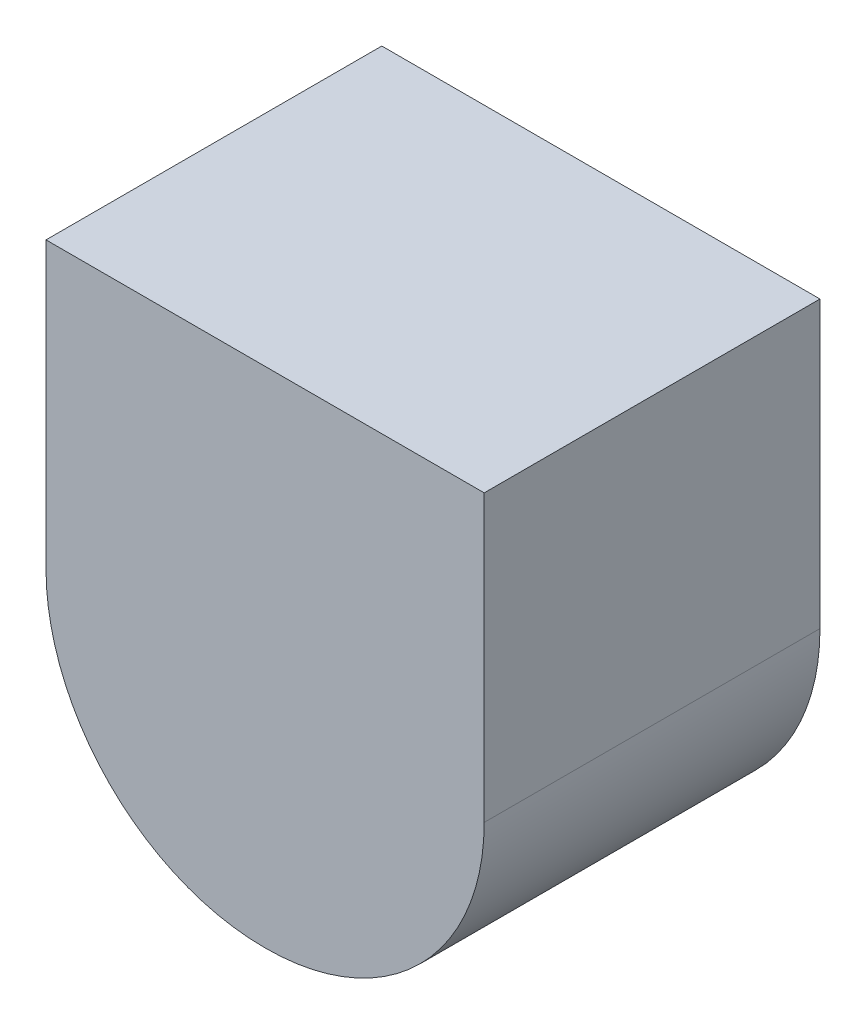
ISO-10303-21;
HEADER;
FILE_DESCRIPTION(('STEP AP214'),'2;1');
FILE_NAME('part.step','',(''),(''),'','','');
FILE_SCHEMA(('AUTOMOTIVE_DESIGN { 1 0 10303 214 1 1 1 1 }'));
ENDSEC;
DATA;
#1=APPLICATION_CONTEXT('core data for automotive mechanical design processes');
#2=APPLICATION_PROTOCOL_DEFINITION('international standard','automotive_design',2000,#1);
#3=PRODUCT_CONTEXT('',#1,'mechanical');
#4=PRODUCT('Part','Part','',(#3));
#5=PRODUCT_RELATED_PRODUCT_CATEGORY('part','',(#4));
#6=PRODUCT_DEFINITION_FORMATION('','',#4);
#7=PRODUCT_DEFINITION_CONTEXT('part definition',#1,'design');
#8=PRODUCT_DEFINITION('design','',#6,#7);
#9=PRODUCT_DEFINITION_SHAPE('','',#8);
#10=(LENGTH_UNIT() NAMED_UNIT(*) SI_UNIT(.MILLI.,.METRE.));
#11=(NAMED_UNIT(*) PLANE_ANGLE_UNIT() SI_UNIT($,.RADIAN.));
#12=(NAMED_UNIT(*) SI_UNIT($,.STERADIAN.) SOLID_ANGLE_UNIT());
#13=UNCERTAINTY_MEASURE_WITH_UNIT(LENGTH_MEASURE(1.E-05),#10,'distance_accuracy_value','');
#14=(GEOMETRIC_REPRESENTATION_CONTEXT(3) GLOBAL_UNCERTAINTY_ASSIGNED_CONTEXT((#13)) GLOBAL_UNIT_ASSIGNED_CONTEXT((#10,
#11,#12)) REPRESENTATION_CONTEXT('',''));
#15=CARTESIAN_POINT('',(0.,0.,0.));
#16=DIRECTION('',(0.,0.,1.));
#17=DIRECTION('',(1.,0.,0.));
#18=AXIS2_PLACEMENT_3D('',#15,#16,#17);
#19=CARTESIAN_POINT('',(0.13050012,2.99999908,0.1999996));
#20=DIRECTION('',(0.,0.,-1.));
#21=DIRECTION('',(-1.,0.,0.));
#22=AXIS2_PLACEMENT_3D('',#19,#20,#21);
#23=PLANE('',#22);
#24=DIRECTION('',(-1.,0.,0.));
#25=VECTOR('',#24,1.);
#26=CARTESIAN_POINT('',(-0.13050012,2.69999968,0.1999996));
#27=LINE('',#26,#25);
#28=CARTESIAN_POINT('',(0.000500119999999989,2.69999968,0.1999996));
#29=VERTEX_POINT('',#28);
#30=CARTESIAN_POINT('',(-0.00050012000000002,2.69999968,0.1999996));
#31=VERTEX_POINT('',#30);
#32=EDGE_CURVE('E11',#29,#31,#27,.T.);
#33=ORIENTED_EDGE('',*,*,#32,.F.);
#34=CARTESIAN_POINT('',(0.00050012,2.82999968,0.1999996));
#35=DIRECTION('',(0.,0.,-1.));
#36=DIRECTION('',(1.,0.,0.));
#37=AXIS2_PLACEMENT_3D('',#34,#35,#36);
#38=CIRCLE('',#37,0.13);
#39=CARTESIAN_POINT('',(0.13050012,2.82999968,0.1999996));
#40=VERTEX_POINT('',#39);
#41=EDGE_CURVE('E24',#40,#29,#38,.T.);
#42=ORIENTED_EDGE('',*,*,#41,.F.);
#43=DIRECTION('',(0.,-1.,0.));
#44=VECTOR('',#43,1.);
#45=CARTESIAN_POINT('',(0.13050012,2.99999908,0.1999996));
#46=LINE('',#45,#44);
#47=CARTESIAN_POINT('',(0.13050012,2.99999908,0.1999996));
#48=VERTEX_POINT('',#47);
#49=EDGE_CURVE('E117',#48,#40,#46,.T.);
#50=ORIENTED_EDGE('',*,*,#49,.F.);
#51=DIRECTION('',(1.,0.,0.));
#52=VECTOR('',#51,1.);
#53=CARTESIAN_POINT('',(0.13050012,2.99999908,0.1999996));
#54=LINE('',#53,#52);
#55=CARTESIAN_POINT('',(-0.13050012,2.99999908,0.1999996));
#56=VERTEX_POINT('',#55);
#57=EDGE_CURVE('E115',#56,#48,#54,.T.);
#58=ORIENTED_EDGE('',*,*,#57,.F.);
#59=DIRECTION('',(0.,1.,0.));
#60=VECTOR('',#59,1.);
#61=CARTESIAN_POINT('',(-0.13050012,2.99999908,0.1999996));
#62=LINE('',#61,#60);
#63=CARTESIAN_POINT('',(-0.13050012,2.82999968,0.1999996));
#64=VERTEX_POINT('',#63);
#65=EDGE_CURVE('E73',#64,#56,#62,.T.);
#66=ORIENTED_EDGE('',*,*,#65,.F.);
#67=CARTESIAN_POINT('',(-0.00050012,2.82999968,0.1999996));
#68=DIRECTION('',(0.,0.,-1.));
#69=DIRECTION('',(1.,0.,0.));
#70=AXIS2_PLACEMENT_3D('',#67,#68,#69);
#71=CIRCLE('',#70,0.13);
#72=EDGE_CURVE('E111',#31,#64,#71,.T.);
#73=ORIENTED_EDGE('',*,*,#72,.F.);
#74=EDGE_LOOP('',(#33,#42,#50,#58,#66,#73));
#75=FACE_BOUND('',#74,.T.);
#76=ADVANCED_FACE('F17',(#75),#23,.F.);
#77=CARTESIAN_POINT('',(-0.00050012,2.82999968,0.));
#78=DIRECTION('',(0.,0.,1.));
#79=DIRECTION('',(1.,0.,0.));
#80=AXIS2_PLACEMENT_3D('',#77,#78,#79);
#81=CYLINDRICAL_SURFACE('',#80,0.13);
#82=ORIENTED_EDGE('',*,*,#72,.T.);
#83=DIRECTION('',(0.,0.,-1.));
#84=VECTOR('',#83,1.);
#85=CARTESIAN_POINT('',(-0.13050012,2.82999968,0.));
#86=LINE('',#85,#84);
#87=CARTESIAN_POINT('',(-0.13050012,2.82999968,0.));
#88=VERTEX_POINT('',#87);
#89=EDGE_CURVE('E109',#64,#88,#86,.T.);
#90=ORIENTED_EDGE('',*,*,#89,.T.);
#91=CARTESIAN_POINT('',(-0.00050012,2.82999968,0.));
#92=DIRECTION('',(0.,0.,1.));
#93=DIRECTION('',(1.,0.,0.));
#94=AXIS2_PLACEMENT_3D('',#91,#92,#93);
#95=CIRCLE('',#94,0.13);
#96=CARTESIAN_POINT('',(-0.000500120000000012,2.69999968,0.));
#97=VERTEX_POINT('',#96);
#98=EDGE_CURVE('E89',#88,#97,#95,.T.);
#99=ORIENTED_EDGE('',*,*,#98,.T.);
#100=DIRECTION('',(0.,0.,1.));
#101=VECTOR('',#100,1.);
#102=CARTESIAN_POINT('',(-0.000500120000000024,2.69999968,0.));
#103=LINE('',#102,#101);
#104=EDGE_CURVE('E105',#97,#31,#103,.T.);
#105=ORIENTED_EDGE('',*,*,#104,.T.);
#106=EDGE_LOOP('',(#82,#90,#99,#105));
#107=FACE_BOUND('',#106,.T.);
#108=ADVANCED_FACE('F127',(#107),#81,.T.);
#109=CARTESIAN_POINT('',(-0.13050012,2.69999968,0.));
#110=DIRECTION('',(0.,1.,0.));
#111=DIRECTION('',(-1.,0.,0.));
#112=AXIS2_PLACEMENT_3D('',#109,#110,#111);
#113=PLANE('',#112);
#114=DIRECTION('',(-1.,0.,0.));
#115=VECTOR('',#114,1.);
#116=CARTESIAN_POINT('',(0.13050012,2.69999968,0.));
#117=LINE('',#116,#115);
#118=CARTESIAN_POINT('',(0.000500119999999997,2.69999968,0.));
#119=VERTEX_POINT('',#118);
#120=EDGE_CURVE('E103',#119,#97,#117,.T.);
#121=ORIENTED_EDGE('',*,*,#120,.F.);
#122=DIRECTION('',(0.,0.,-1.));
#123=VECTOR('',#122,1.);
#124=CARTESIAN_POINT('',(0.000500119999999993,2.69999968,0.));
#125=LINE('',#124,#123);
#126=EDGE_CURVE('E100',#29,#119,#125,.T.);
#127=ORIENTED_EDGE('',*,*,#126,.F.);
#128=ORIENTED_EDGE('',*,*,#32,.T.);
#129=ORIENTED_EDGE('',*,*,#104,.F.);
#130=EDGE_LOOP('',(#121,#127,#128,#129));
#131=FACE_BOUND('',#130,.T.);
#132=ADVANCED_FACE('F123',(#131),#113,.F.);
#133=CARTESIAN_POINT('',(0.00050012,2.82999968,0.));
#134=DIRECTION('',(0.,0.,1.));
#135=DIRECTION('',(1.,0.,0.));
#136=AXIS2_PLACEMENT_3D('',#133,#134,#135);
#137=CYLINDRICAL_SURFACE('',#136,0.13);
#138=ORIENTED_EDGE('',*,*,#41,.T.);
#139=ORIENTED_EDGE('',*,*,#126,.T.);
#140=CARTESIAN_POINT('',(0.00050012,2.82999968,0.));
#141=DIRECTION('',(0.,0.,1.));
#142=DIRECTION('',(1.,0.,0.));
#143=AXIS2_PLACEMENT_3D('',#140,#141,#142);
#144=CIRCLE('',#143,0.13);
#145=CARTESIAN_POINT('',(0.13050012,2.82999968,0.));
#146=VERTEX_POINT('',#145);
#147=EDGE_CURVE('E98',#119,#146,#144,.T.);
#148=ORIENTED_EDGE('',*,*,#147,.T.);
#149=DIRECTION('',(0.,0.,1.));
#150=VECTOR('',#149,1.);
#151=CARTESIAN_POINT('',(0.13050012,2.82999968,0.));
#152=LINE('',#151,#150);
#153=EDGE_CURVE('E95',#146,#40,#152,.T.);
#154=ORIENTED_EDGE('',*,*,#153,.T.);
#155=EDGE_LOOP('',(#138,#139,#148,#154));
#156=FACE_BOUND('',#155,.T.);
#157=ADVANCED_FACE('F120',(#156),#137,.T.);
#158=CARTESIAN_POINT('',(0.13050012,2.69999968,0.));
#159=DIRECTION('',(-1.,0.,0.));
#160=DIRECTION('',(0.,-1.,0.));
#161=AXIS2_PLACEMENT_3D('',#158,#159,#160);
#162=PLANE('',#161);
#163=DIRECTION('',(0.,-1.,0.));
#164=VECTOR('',#163,1.);
#165=CARTESIAN_POINT('',(0.13050012,2.69999968,0.));
#166=LINE('',#165,#164);
#167=CARTESIAN_POINT('',(0.13050012,2.99999908,0.));
#168=VERTEX_POINT('',#167);
#169=EDGE_CURVE('E93',#168,#146,#166,.T.);
#170=ORIENTED_EDGE('',*,*,#169,.F.);
#171=DIRECTION('',(0.,0.,-1.));
#172=VECTOR('',#171,1.);
#173=CARTESIAN_POINT('',(0.13050012,2.99999908,0.));
#174=LINE('',#173,#172);
#175=EDGE_CURVE('E76',#48,#168,#174,.T.);
#176=ORIENTED_EDGE('',*,*,#175,.F.);
#177=ORIENTED_EDGE('',*,*,#49,.T.);
#178=ORIENTED_EDGE('',*,*,#153,.F.);
#179=EDGE_LOOP('',(#170,#176,#177,#178));
#180=FACE_BOUND('',#179,.T.);
#181=ADVANCED_FACE('F125',(#180),#162,.F.);
#182=CARTESIAN_POINT('',(0.13050012,2.99999908,0.));
#183=DIRECTION('',(0.,-1.,0.));
#184=DIRECTION('',(1.,0.,0.));
#185=AXIS2_PLACEMENT_3D('',#182,#183,#184);
#186=PLANE('',#185);
#187=DIRECTION('',(0.,0.,-1.));
#188=VECTOR('',#187,1.);
#189=CARTESIAN_POINT('',(-0.13050012,2.99999908,0.));
#190=LINE('',#189,#188);
#191=CARTESIAN_POINT('',(-0.13050012,2.99999908,0.));
#192=VERTEX_POINT('',#191);
#193=EDGE_CURVE('E67',#56,#192,#190,.T.);
#194=ORIENTED_EDGE('',*,*,#193,.F.);
#195=ORIENTED_EDGE('',*,*,#57,.T.);
#196=ORIENTED_EDGE('',*,*,#175,.T.);
#197=DIRECTION('',(1.,0.,0.));
#198=VECTOR('',#197,1.);
#199=CARTESIAN_POINT('',(0.13050012,2.99999908,0.));
#200=LINE('',#199,#198);
#201=EDGE_CURVE('E77',#192,#168,#200,.T.);
#202=ORIENTED_EDGE('',*,*,#201,.F.);
#203=EDGE_LOOP('',(#194,#195,#196,#202));
#204=FACE_BOUND('',#203,.T.);
#205=ADVANCED_FACE('F81',(#204),#186,.F.);
#206=CARTESIAN_POINT('',(-0.13050012,2.99999908,0.));
#207=DIRECTION('',(1.,0.,0.));
#208=DIRECTION('',(0.,1.,0.));
#209=AXIS2_PLACEMENT_3D('',#206,#207,#208);
#210=PLANE('',#209);
#211=DIRECTION('',(0.,1.,0.));
#212=VECTOR('',#211,1.);
#213=CARTESIAN_POINT('',(-0.13050012,2.99999908,0.));
#214=LINE('',#213,#212);
#215=EDGE_CURVE('E72',#88,#192,#214,.T.);
#216=ORIENTED_EDGE('',*,*,#215,.F.);
#217=ORIENTED_EDGE('',*,*,#89,.F.);
#218=ORIENTED_EDGE('',*,*,#65,.T.);
#219=ORIENTED_EDGE('',*,*,#193,.T.);
#220=EDGE_LOOP('',(#216,#217,#218,#219));
#221=FACE_BOUND('',#220,.T.);
#222=ADVANCED_FACE('F69',(#221),#210,.F.);
#223=CARTESIAN_POINT('',(0.13050012,2.99999908,0.));
#224=DIRECTION('',(0.,0.,-1.));
#225=DIRECTION('',(-1.,0.,0.));
#226=AXIS2_PLACEMENT_3D('',#223,#224,#225);
#227=PLANE('',#226);
#228=ORIENTED_EDGE('',*,*,#120,.T.);
#229=ORIENTED_EDGE('',*,*,#98,.F.);
#230=ORIENTED_EDGE('',*,*,#215,.T.);
#231=ORIENTED_EDGE('',*,*,#201,.T.);
#232=ORIENTED_EDGE('',*,*,#169,.T.);
#233=ORIENTED_EDGE('',*,*,#147,.F.);
#234=EDGE_LOOP('',(#228,#229,#230,#231,#232,#233));
#235=FACE_BOUND('',#234,.T.);
#236=ADVANCED_FACE('F88',(#235),#227,.T.);
#237=CLOSED_SHELL('',(#76,#108,#132,#157,#181,#205,#222,#236));
#238=MANIFOLD_SOLID_BREP('B1',#237);
#239=ADVANCED_BREP_SHAPE_REPRESENTATION('',(#18,#238),#14);
#240=SHAPE_DEFINITION_REPRESENTATION(#9,#239);
ENDSEC;
END-ISO-10303-21;
